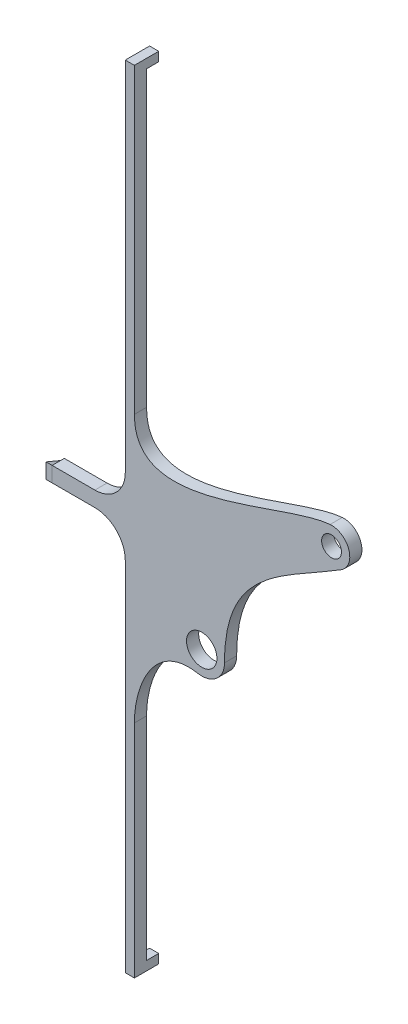
ISO-10303-21;
HEADER;
FILE_DESCRIPTION(('STEP AP214'),'2;1');
FILE_NAME('part.step','',(''),(''),'','','');
FILE_SCHEMA(('AUTOMOTIVE_DESIGN { 1 0 10303 214 1 1 1 1 }'));
ENDSEC;
DATA;
#1=APPLICATION_CONTEXT('core data for automotive mechanical design processes');
#2=APPLICATION_PROTOCOL_DEFINITION('international standard','automotive_design',2000,#1);
#3=PRODUCT_CONTEXT('',#1,'mechanical');
#4=PRODUCT('Part','Part','',(#3));
#5=PRODUCT_RELATED_PRODUCT_CATEGORY('part','',(#4));
#6=PRODUCT_DEFINITION_FORMATION('','',#4);
#7=PRODUCT_DEFINITION_CONTEXT('part definition',#1,'design');
#8=PRODUCT_DEFINITION('design','',#6,#7);
#9=PRODUCT_DEFINITION_SHAPE('','',#8);
#10=(LENGTH_UNIT() NAMED_UNIT(*) SI_UNIT(.MILLI.,.METRE.));
#11=(NAMED_UNIT(*) PLANE_ANGLE_UNIT() SI_UNIT($,.RADIAN.));
#12=(NAMED_UNIT(*) SI_UNIT($,.STERADIAN.) SOLID_ANGLE_UNIT());
#13=UNCERTAINTY_MEASURE_WITH_UNIT(LENGTH_MEASURE(1.E-05),#10,'distance_accuracy_value','');
#14=(GEOMETRIC_REPRESENTATION_CONTEXT(3) GLOBAL_UNCERTAINTY_ASSIGNED_CONTEXT((#13)) GLOBAL_UNIT_ASSIGNED_CONTEXT((#10,
#11,#12)) REPRESENTATION_CONTEXT('',''));
#15=CARTESIAN_POINT('',(0.,0.,0.));
#16=DIRECTION('',(0.,0.,1.));
#17=DIRECTION('',(1.,0.,0.));
#18=AXIS2_PLACEMENT_3D('',#15,#16,#17);
#19=CARTESIAN_POINT('',(-24.0499999999999,-2.50000000000001,4.));
#20=DIRECTION('',(0.,0.,-1.));
#21=DIRECTION('',(-1.,0.,0.));
#22=AXIS2_PLACEMENT_3D('',#19,#20,#21);
#23=PLANE('',#22);
#24=DIRECTION('',(0.,1.,0.));
#25=VECTOR('',#24,1.);
#26=CARTESIAN_POINT('',(-22.0499999999999,-2.50000000000001,4.));
#27=LINE('',#26,#25);
#28=CARTESIAN_POINT('',(-22.0499999999999,-2.50000000000001,4.));
#29=VERTEX_POINT('',#28);
#30=CARTESIAN_POINT('',(-22.0499999999999,2.50000000000002,4.));
#31=VERTEX_POINT('',#30);
#32=EDGE_CURVE('E92',#29,#31,#27,.T.);
#33=ORIENTED_EDGE('',*,*,#32,.T.);
#34=DIRECTION('',(1.,0.,0.));
#35=VECTOR('',#34,1.);
#36=CARTESIAN_POINT('',(-24.0499999999999,2.50000000000002,4.));
#37=LINE('',#36,#35);
#38=CARTESIAN_POINT('',(-24.0499999999999,2.50000000000002,4.));
#39=VERTEX_POINT('',#38);
#40=EDGE_CURVE('E12',#39,#31,#37,.T.);
#41=ORIENTED_EDGE('',*,*,#40,.F.);
#42=DIRECTION('',(0.,1.,0.));
#43=VECTOR('',#42,1.);
#44=CARTESIAN_POINT('',(-24.0499999999999,-2.50000000000001,4.));
#45=LINE('',#44,#43);
#46=CARTESIAN_POINT('',(-24.0499999999999,-2.50000000000001,4.));
#47=VERTEX_POINT('',#46);
#48=EDGE_CURVE('E85',#47,#39,#45,.T.);
#49=ORIENTED_EDGE('',*,*,#48,.F.);
#50=DIRECTION('',(1.,0.,0.));
#51=VECTOR('',#50,1.);
#52=CARTESIAN_POINT('',(-24.0499999999999,-2.50000000000001,4.));
#53=LINE('',#52,#51);
#54=EDGE_CURVE('E93',#47,#29,#53,.T.);
#55=ORIENTED_EDGE('',*,*,#54,.T.);
#56=EDGE_LOOP('',(#33,#41,#49,#55));
#57=FACE_BOUND('',#56,.T.);
#58=ADVANCED_FACE('F45',(#57),#23,.F.);
#59=CARTESIAN_POINT('',(-24.0499999999999,0.,-2.));
#60=DIRECTION('',(0.,-0.923076923076922,0.384615384615387));
#61=DIRECTION('',(0.,-0.384615384615387,-0.923076923076922));
#62=AXIS2_PLACEMENT_3D('',#59,#60,#61);
#63=PLANE('',#62);
#64=DIRECTION('',(0.,-0.384615384615387,-0.923076923076922));
#65=VECTOR('',#64,1.);
#66=CARTESIAN_POINT('',(-22.0499999999999,0.,-2.));
#67=LINE('',#66,#65);
#68=CARTESIAN_POINT('',(-22.0499999999999,0.,-2.));
#69=VERTEX_POINT('',#68);
#70=EDGE_CURVE('E73',#31,#69,#67,.T.);
#71=ORIENTED_EDGE('',*,*,#70,.T.);
#72=DIRECTION('',(1.,0.,0.));
#73=VECTOR('',#72,1.);
#74=CARTESIAN_POINT('',(-24.0499999999999,0.,-2.));
#75=LINE('',#74,#73);
#76=CARTESIAN_POINT('',(-24.0499999999999,0.,-2.));
#77=VERTEX_POINT('',#76);
#78=EDGE_CURVE('E53',#77,#69,#75,.T.);
#79=ORIENTED_EDGE('',*,*,#78,.F.);
#80=DIRECTION('',(0.,-0.384615384615387,-0.923076923076922));
#81=VECTOR('',#80,1.);
#82=CARTESIAN_POINT('',(-24.0499999999999,0.,-2.));
#83=LINE('',#82,#81);
#84=EDGE_CURVE('E81',#39,#77,#83,.T.);
#85=ORIENTED_EDGE('',*,*,#84,.F.);
#86=ORIENTED_EDGE('',*,*,#40,.T.);
#87=EDGE_LOOP('',(#71,#79,#85,#86));
#88=FACE_BOUND('',#87,.T.);
#89=ADVANCED_FACE('F82',(#88),#63,.F.);
#90=CARTESIAN_POINT('',(-24.0499999999999,-2.50000000000001,4.));
#91=DIRECTION('',(0.,0.923076923076922,0.384615384615386));
#92=DIRECTION('',(0.,-0.384615384615386,0.923076923076922));
#93=AXIS2_PLACEMENT_3D('',#90,#91,#92);
#94=PLANE('',#93);
#95=DIRECTION('',(0.,-0.384615384615386,0.923076923076922));
#96=VECTOR('',#95,1.);
#97=CARTESIAN_POINT('',(-22.0499999999999,-2.50000000000001,4.));
#98=LINE('',#97,#96);
#99=EDGE_CURVE('E78',#69,#29,#98,.T.);
#100=ORIENTED_EDGE('',*,*,#99,.T.);
#101=ORIENTED_EDGE('',*,*,#54,.F.);
#102=DIRECTION('',(0.,-0.384615384615386,0.923076923076922));
#103=VECTOR('',#102,1.);
#104=CARTESIAN_POINT('',(-24.0499999999999,-2.50000000000001,4.));
#105=LINE('',#104,#103);
#106=EDGE_CURVE('E61',#77,#47,#105,.T.);
#107=ORIENTED_EDGE('',*,*,#106,.F.);
#108=ORIENTED_EDGE('',*,*,#78,.T.);
#109=EDGE_LOOP('',(#100,#101,#107,#108));
#110=FACE_BOUND('',#109,.T.);
#111=ADVANCED_FACE('F100',(#110),#94,.F.);
#112=CARTESIAN_POINT('',(-24.0499999999999,0.,0.));
#113=DIRECTION('',(1.,0.,0.));
#114=DIRECTION('',(0.,0.,-1.));
#115=AXIS2_PLACEMENT_3D('',#112,#113,#114);
#116=PLANE('',#115);
#117=ORIENTED_EDGE('',*,*,#48,.T.);
#118=ORIENTED_EDGE('',*,*,#84,.T.);
#119=ORIENTED_EDGE('',*,*,#106,.T.);
#120=EDGE_LOOP('',(#117,#118,#119));
#121=FACE_BOUND('',#120,.T.);
#122=ADVANCED_FACE('F88',(#121),#116,.F.);
#123=CARTESIAN_POINT('',(-22.0499999999999,0.,0.));
#124=DIRECTION('',(1.,0.,0.));
#125=DIRECTION('',(0.,0.,-1.));
#126=AXIS2_PLACEMENT_3D('',#123,#124,#125);
#127=PLANE('',#126);
#128=ORIENTED_EDGE('',*,*,#32,.F.);
#129=ORIENTED_EDGE('',*,*,#99,.F.);
#130=ORIENTED_EDGE('',*,*,#70,.F.);
#131=EDGE_LOOP('',(#128,#129,#130));
#132=FACE_BOUND('',#131,.T.);
#133=ADVANCED_FACE('F101',(#132),#127,.T.);
#134=CLOSED_SHELL('',(#58,#89,#111,#122,#133));
#135=MANIFOLD_SOLID_BREP('B2',#134);
#136=CARTESIAN_POINT('',(0.,0.,0.));
#137=DIRECTION('',(0.,0.,1.));
#138=DIRECTION('',(1.,0.,0.));
#139=AXIS2_PLACEMENT_3D('',#136,#137,#138);
#140=PLANE('',#139);
#141=CARTESIAN_POINT('',(69.85,25.4,0.));
#142=DIRECTION('',(0.,0.,1.));
#143=DIRECTION('',(1.,0.,0.));
#144=AXIS2_PLACEMENT_3D('',#141,#142,#143);
#145=CIRCLE('',#144,3.26389999999999);
#146=CARTESIAN_POINT('',(73.1139,25.4,0.));
#147=VERTEX_POINT('',#146);
#148=EDGE_CURVE('E340',#147,#147,#145,.T.);
#149=ORIENTED_EDGE('',*,*,#148,.T.);
#150=EDGE_LOOP('',(#149));
#151=FACE_BOUND('',#150,.T.);
#152=CARTESIAN_POINT('',(27.15,-25.4,0.));
#153=DIRECTION('',(0.,0.,1.));
#154=DIRECTION('',(1.,0.,0.));
#155=AXIS2_PLACEMENT_3D('',#152,#153,#154);
#156=CIRCLE('',#155,5.);
#157=CARTESIAN_POINT('',(32.15,-25.4,0.));
#158=VERTEX_POINT('',#157);
#159=EDGE_CURVE('E458',#158,#158,#156,.T.);
#160=ORIENTED_EDGE('',*,*,#159,.T.);
#161=EDGE_LOOP('',(#160));
#162=FACE_BOUND('',#161,.T.);
#163=DIRECTION('',(-1.,0.,0.));
#164=VECTOR('',#163,1.);
#165=CARTESIAN_POINT('',(0.,127.,0.));
#166=LINE('',#165,#164);
#167=CARTESIAN_POINT('',(5.00000000000001,127.,0.));
#168=VERTEX_POINT('',#167);
#169=CARTESIAN_POINT('',(2.00000000000001,127.,0.));
#170=VERTEX_POINT('',#169);
#171=EDGE_CURVE('E305',#168,#170,#166,.T.);
#172=ORIENTED_EDGE('',*,*,#171,.F.);
#173=DIRECTION('',(0.,-1.,0.));
#174=VECTOR('',#173,1.);
#175=CARTESIAN_POINT('',(5.00000000000001,0.,0.));
#176=LINE('',#175,#174);
#177=CARTESIAN_POINT('',(5.00000000000001,30.5708800073371,0.));
#178=VERTEX_POINT('',#177);
#179=EDGE_CURVE('E295',#168,#178,#176,.T.);
#180=ORIENTED_EDGE('',*,*,#179,.T.);
#181=CARTESIAN_POINT('',(5.00000000000002,30.5708800073371,0.));
#182=CARTESIAN_POINT('',(5.00000000000002,2.644791947933,0.));
#183=CARTESIAN_POINT('',(53.2787246403706,30.0687012589804,0.));
#184=CARTESIAN_POINT('',(69.3623819699283,31.3801528957669,0.));
#185=B_SPLINE_CURVE_WITH_KNOTS('',3,(#181,#182,#183,#184),.UNSPECIFIED.,.F.,.F.,(4,4),(0.,1.),.UNSPECIFIED.);
#186=CARTESIAN_POINT('',(69.3623819699283,31.3801528957669,0.));
#187=VERTEX_POINT('',#186);
#188=EDGE_CURVE('E424',#178,#187,#185,.T.);
#189=ORIENTED_EDGE('',*,*,#188,.T.);
#190=CARTESIAN_POINT('',(69.85,25.4,0.));
#191=DIRECTION('',(0.,0.,1.));
#192=DIRECTION('',(1.,0.,0.));
#193=AXIS2_PLACEMENT_3D('',#190,#191,#192);
#194=CIRCLE('',#193,6.);
#195=CARTESIAN_POINT('',(73.0223668687448,20.3072513855394,0.));
#196=VERTEX_POINT('',#195);
#197=EDGE_CURVE('E418',#196,#187,#194,.T.);
#198=ORIENTED_EDGE('',*,*,#197,.F.);
#199=CARTESIAN_POINT('',(73.0223668687447,20.3072513855397,0.));
#200=CARTESIAN_POINT('',(54.015932593088,8.46779356940645,0.));
#201=CARTESIAN_POINT('',(34.6134957490647,2.87312155456971,0.));
#202=CARTESIAN_POINT('',(34.6499937465617,-25.3903148807254,0.));
#203=B_SPLINE_CURVE_WITH_KNOTS('',3,(#199,#200,#201,#202),.UNSPECIFIED.,.F.,.F.,(4,4),(0.,1.),.UNSPECIFIED.);
#204=CARTESIAN_POINT('',(34.6499937465617,-25.3903148807254,0.));
#205=VERTEX_POINT('',#204);
#206=EDGE_CURVE('E331',#196,#205,#203,.T.);
#207=ORIENTED_EDGE('',*,*,#206,.T.);
#208=CARTESIAN_POINT('',(27.15,-25.4,0.));
#209=DIRECTION('',(0.,0.,1.));
#210=DIRECTION('',(1.,0.,0.));
#211=AXIS2_PLACEMENT_3D('',#208,#209,#210);
#212=CIRCLE('',#211,7.5);
#213=CARTESIAN_POINT('',(25.812302368487,-32.7797401747382,0.));
#214=VERTEX_POINT('',#213);
#215=EDGE_CURVE('E452',#214,#205,#212,.T.);
#216=ORIENTED_EDGE('',*,*,#215,.F.);
#217=CARTESIAN_POINT('',(25.812302368487,-32.7797401747382,0.));
#218=CARTESIAN_POINT('',(11.7792875112904,-30.2360285679641,0.));
#219=CARTESIAN_POINT('',(4.99999999999995,-45.7386077924524,0.));
#220=CARTESIAN_POINT('',(5.00000000000001,-57.3401483146963,0.));
#221=B_SPLINE_CURVE_WITH_KNOTS('',3,(#217,#218,#219,#220),.UNSPECIFIED.,.F.,.F.,(4,4),(0.,1.),.UNSPECIFIED.);
#222=CARTESIAN_POINT('',(5.00000000000001,-57.3401483146963,0.));
#223=VERTEX_POINT('',#222);
#224=EDGE_CURVE('E447',#214,#223,#221,.T.);
#225=ORIENTED_EDGE('',*,*,#224,.T.);
#226=CARTESIAN_POINT('',(5.00000000000001,-127.,0.));
#227=VERTEX_POINT('',#226);
#228=EDGE_CURVE('E434',#223,#227,#176,.T.);
#229=ORIENTED_EDGE('',*,*,#228,.T.);
#230=DIRECTION('',(-1.,0.,0.));
#231=VECTOR('',#230,1.);
#232=CARTESIAN_POINT('',(0.,-127.,0.));
#233=LINE('',#232,#231);
#234=CARTESIAN_POINT('',(2.00000000000001,-127.,0.));
#235=VERTEX_POINT('',#234);
#236=EDGE_CURVE('E311',#227,#235,#233,.T.);
#237=ORIENTED_EDGE('',*,*,#236,.T.);
#238=DIRECTION('',(0.,-1.,0.));
#239=VECTOR('',#238,1.);
#240=CARTESIAN_POINT('',(2.00000000000001,0.,0.));
#241=LINE('',#240,#239);
#242=CARTESIAN_POINT('',(2.00000000000001,-12.5,0.));
#243=VERTEX_POINT('',#242);
#244=EDGE_CURVE('E445',#243,#235,#241,.T.);
#245=ORIENTED_EDGE('',*,*,#244,.F.);
#246=CARTESIAN_POINT('',(-7.99999999999999,-12.5,0.));
#247=DIRECTION('',(0.,0.,1.));
#248=DIRECTION('',(1.,0.,0.));
#249=AXIS2_PLACEMENT_3D('',#246,#247,#248);
#250=CIRCLE('',#249,10.);
#251=CARTESIAN_POINT('',(-7.99999999999999,-2.5,0.));
#252=VERTEX_POINT('',#251);
#253=EDGE_CURVE('E151',#243,#252,#250,.T.);
#254=ORIENTED_EDGE('',*,*,#253,.T.);
#255=DIRECTION('',(1.,0.,0.));
#256=VECTOR('',#255,1.);
#257=CARTESIAN_POINT('',(0.,-2.5,0.));
#258=LINE('',#257,#256);
#259=CARTESIAN_POINT('',(-22.0499999999999,-2.5,0.));
#260=VERTEX_POINT('',#259);
#261=EDGE_CURVE('E443',#260,#252,#258,.T.);
#262=ORIENTED_EDGE('',*,*,#261,.F.);
#263=DIRECTION('',(0.,1.,0.));
#264=VECTOR('',#263,1.);
#265=CARTESIAN_POINT('',(-22.0499999999999,0.,0.));
#266=LINE('',#265,#264);
#267=CARTESIAN_POINT('',(-22.0499999999999,2.5,0.));
#268=VERTEX_POINT('',#267);
#269=EDGE_CURVE('E440',#260,#268,#266,.T.);
#270=ORIENTED_EDGE('',*,*,#269,.T.);
#271=DIRECTION('',(1.,0.,0.));
#272=VECTOR('',#271,1.);
#273=CARTESIAN_POINT('',(0.,2.5,0.));
#274=LINE('',#273,#272);
#275=CARTESIAN_POINT('',(-7.99999999999999,2.5,0.));
#276=VERTEX_POINT('',#275);
#277=EDGE_CURVE('E437',#268,#276,#274,.T.);
#278=ORIENTED_EDGE('',*,*,#277,.T.);
#279=CARTESIAN_POINT('',(-7.99999999999999,12.5,0.));
#280=DIRECTION('',(0.,0.,1.));
#281=DIRECTION('',(1.,0.,0.));
#282=AXIS2_PLACEMENT_3D('',#279,#280,#281);
#283=CIRCLE('',#282,10.);
#284=CARTESIAN_POINT('',(2.00000000000001,12.5,0.));
#285=VERTEX_POINT('',#284);
#286=EDGE_CURVE('E494',#276,#285,#283,.T.);
#287=ORIENTED_EDGE('',*,*,#286,.T.);
#288=DIRECTION('',(0.,-1.,0.));
#289=VECTOR('',#288,1.);
#290=CARTESIAN_POINT('',(2.00000000000001,0.,0.));
#291=LINE('',#290,#289);
#292=EDGE_CURVE('E433',#170,#285,#291,.T.);
#293=ORIENTED_EDGE('',*,*,#292,.F.);
#294=EDGE_LOOP('',(#172,#180,#189,#198,#207,#216,#225,#229,#237,#245,#254,#262,#270,#278,#287,#293));
#295=FACE_BOUND('',#294,.T.);
#296=ADVANCED_FACE('F143',(#151,#162,#295),#140,.F.);
#297=CARTESIAN_POINT('',(73.0223668687447,20.3072513855397,4.));
#298=CARTESIAN_POINT('',(54.015932593088,8.46779356940645,4.));
#299=CARTESIAN_POINT('',(34.6134957490647,2.87312155456971,4.));
#300=CARTESIAN_POINT('',(34.6499937465617,-25.3903148807254,4.));
#301=B_SPLINE_CURVE_WITH_KNOTS('',3,(#297,#298,#299,#300),.UNSPECIFIED.,.F.,.F.,(4,4),(0.,1.),.UNSPECIFIED.);
#302=DIRECTION('',(0.,0.,-1.));
#303=VECTOR('',#302,1.);
#304=SURFACE_OF_LINEAR_EXTRUSION('',#301,#303);
#305=ORIENTED_EDGE('',*,*,#206,.F.);
#306=DIRECTION('',(0.,0.,-1.));
#307=VECTOR('',#306,1.);
#308=CARTESIAN_POINT('',(73.0223668687448,20.3072513855394,4.));
#309=LINE('',#308,#307);
#310=CARTESIAN_POINT('',(73.0223668687448,20.3072513855394,4.));
#311=VERTEX_POINT('',#310);
#312=EDGE_CURVE('E483',#311,#196,#309,.T.);
#313=ORIENTED_EDGE('',*,*,#312,.F.);
#314=CARTESIAN_POINT('',(34.6499937465617,-25.3903148807254,4.));
#315=VERTEX_POINT('',#314);
#316=EDGE_CURVE('E333',#311,#315,#301,.T.);
#317=ORIENTED_EDGE('',*,*,#316,.T.);
#318=DIRECTION('',(0.,0.,-1.));
#319=VECTOR('',#318,1.);
#320=CARTESIAN_POINT('',(34.6499937465617,-25.3903148807254,4.));
#321=LINE('',#320,#319);
#322=EDGE_CURVE('E413',#315,#205,#321,.T.);
#323=ORIENTED_EDGE('',*,*,#322,.T.);
#324=EDGE_LOOP('',(#305,#313,#317,#323));
#325=FACE_BOUND('',#324,.T.);
#326=ADVANCED_FACE('F346',(#325),#304,.T.);
#327=CARTESIAN_POINT('',(69.85,25.4,4.));
#328=DIRECTION('',(0.,0.,-1.));
#329=DIRECTION('',(-1.,0.,0.));
#330=AXIS2_PLACEMENT_3D('',#327,#328,#329);
#331=CYLINDRICAL_SURFACE('',#330,6.);
#332=ORIENTED_EDGE('',*,*,#197,.T.);
#333=DIRECTION('',(0.,0.,-1.));
#334=VECTOR('',#333,1.);
#335=CARTESIAN_POINT('',(69.3623819699283,31.3801528957669,4.));
#336=LINE('',#335,#334);
#337=CARTESIAN_POINT('',(69.3623819699283,31.3801528957669,4.));
#338=VERTEX_POINT('',#337);
#339=EDGE_CURVE('E481',#338,#187,#336,.T.);
#340=ORIENTED_EDGE('',*,*,#339,.F.);
#341=CARTESIAN_POINT('',(69.85,25.4,4.));
#342=DIRECTION('',(0.,0.,1.));
#343=DIRECTION('',(1.,0.,0.));
#344=AXIS2_PLACEMENT_3D('',#341,#342,#343);
#345=CIRCLE('',#344,6.);
#346=EDGE_CURVE('E339',#311,#338,#345,.T.);
#347=ORIENTED_EDGE('',*,*,#346,.F.);
#348=ORIENTED_EDGE('',*,*,#312,.T.);
#349=EDGE_LOOP('',(#332,#340,#347,#348));
#350=FACE_BOUND('',#349,.T.);
#351=ADVANCED_FACE('F349',(#350),#331,.T.);
#352=CARTESIAN_POINT('',(5.00000000000002,30.5708800073371,4.));
#353=CARTESIAN_POINT('',(5.00000000000002,2.644791947933,4.));
#354=CARTESIAN_POINT('',(53.2787246403706,30.0687012589804,4.));
#355=CARTESIAN_POINT('',(69.3623819699283,31.3801528957669,4.));
#356=B_SPLINE_CURVE_WITH_KNOTS('',3,(#352,#353,#354,#355),.UNSPECIFIED.,.F.,.F.,(4,4),(0.,1.),.UNSPECIFIED.);
#357=DIRECTION('',(0.,0.,-1.));
#358=VECTOR('',#357,1.);
#359=SURFACE_OF_LINEAR_EXTRUSION('',#356,#358);
#360=ORIENTED_EDGE('',*,*,#188,.F.);
#361=DIRECTION('',(0.,0.,-1.));
#362=VECTOR('',#361,1.);
#363=CARTESIAN_POINT('',(5.00000000000001,30.5708800073371,4.));
#364=LINE('',#363,#362);
#365=CARTESIAN_POINT('',(5.00000000000001,30.5708800073371,4.));
#366=VERTEX_POINT('',#365);
#367=EDGE_CURVE('E479',#366,#178,#364,.T.);
#368=ORIENTED_EDGE('',*,*,#367,.F.);
#369=EDGE_CURVE('E528',#366,#338,#356,.T.);
#370=ORIENTED_EDGE('',*,*,#369,.T.);
#371=ORIENTED_EDGE('',*,*,#339,.T.);
#372=EDGE_LOOP('',(#360,#368,#370,#371));
#373=FACE_BOUND('',#372,.T.);
#374=ADVANCED_FACE('F526',(#373),#359,.T.);
#375=CARTESIAN_POINT('',(5.00000000000001,0.,4.));
#376=DIRECTION('',(1.,0.,0.));
#377=DIRECTION('',(0.,0.,-1.));
#378=AXIS2_PLACEMENT_3D('',#375,#376,#377);
#379=PLANE('',#378);
#380=ORIENTED_EDGE('',*,*,#179,.F.);
#381=DIRECTION('',(0.,0.,1.));
#382=VECTOR('',#381,1.);
#383=CARTESIAN_POINT('',(5.00000000000001,127.,-4.));
#384=LINE('',#383,#382);
#385=CARTESIAN_POINT('',(5.00000000000001,127.,-4.));
#386=VERTEX_POINT('',#385);
#387=EDGE_CURVE('E292',#386,#168,#384,.T.);
#388=ORIENTED_EDGE('',*,*,#387,.F.);
#389=DIRECTION('',(0.,-1.,0.));
#390=VECTOR('',#389,1.);
#391=CARTESIAN_POINT('',(5.00000000000001,0.,-4.));
#392=LINE('',#391,#390);
#393=CARTESIAN_POINT('',(5.00000000000001,130.,-4.));
#394=VERTEX_POINT('',#393);
#395=EDGE_CURVE('E280',#394,#386,#392,.T.);
#396=ORIENTED_EDGE('',*,*,#395,.F.);
#397=DIRECTION('',(0.,0.,-1.));
#398=VECTOR('',#397,1.);
#399=CARTESIAN_POINT('',(5.00000000000001,130.,4.));
#400=LINE('',#399,#398);
#401=CARTESIAN_POINT('',(5.00000000000001,130.,4.));
#402=VERTEX_POINT('',#401);
#403=EDGE_CURVE('E477',#402,#394,#400,.T.);
#404=ORIENTED_EDGE('',*,*,#403,.F.);
#405=DIRECTION('',(0.,-1.,0.));
#406=VECTOR('',#405,1.);
#407=CARTESIAN_POINT('',(5.00000000000001,0.,4.));
#408=LINE('',#407,#406);
#409=EDGE_CURVE('E522',#402,#366,#408,.T.);
#410=ORIENTED_EDGE('',*,*,#409,.T.);
#411=ORIENTED_EDGE('',*,*,#367,.T.);
#412=EDGE_LOOP('',(#380,#388,#396,#404,#410,#411));
#413=FACE_BOUND('',#412,.T.);
#414=ADVANCED_FACE('F293',(#413),#379,.T.);
#415=CARTESIAN_POINT('',(0.,130.,4.));
#416=DIRECTION('',(0.,1.,0.));
#417=DIRECTION('',(0.,0.,1.));
#418=AXIS2_PLACEMENT_3D('',#415,#416,#417);
#419=PLANE('',#418);
#420=ORIENTED_EDGE('',*,*,#403,.T.);
#421=DIRECTION('',(1.,0.,0.));
#422=VECTOR('',#421,1.);
#423=CARTESIAN_POINT('',(0.,130.,-4.));
#424=LINE('',#423,#422);
#425=CARTESIAN_POINT('',(2.00000000000001,130.,-4.));
#426=VERTEX_POINT('',#425);
#427=EDGE_CURVE('E288',#426,#394,#424,.T.);
#428=ORIENTED_EDGE('',*,*,#427,.F.);
#429=DIRECTION('',(0.,0.,-1.));
#430=VECTOR('',#429,1.);
#431=CARTESIAN_POINT('',(2.00000000000001,130.,4.));
#432=LINE('',#431,#430);
#433=CARTESIAN_POINT('',(2.00000000000001,130.,4.));
#434=VERTEX_POINT('',#433);
#435=EDGE_CURVE('E475',#434,#426,#432,.T.);
#436=ORIENTED_EDGE('',*,*,#435,.F.);
#437=DIRECTION('',(1.,0.,0.));
#438=VECTOR('',#437,1.);
#439=CARTESIAN_POINT('',(0.,130.,4.));
#440=LINE('',#439,#438);
#441=EDGE_CURVE('E567',#434,#402,#440,.T.);
#442=ORIENTED_EDGE('',*,*,#441,.T.);
#443=EDGE_LOOP('',(#420,#428,#436,#442));
#444=FACE_BOUND('',#443,.T.);
#445=ADVANCED_FACE('F578',(#444),#419,.T.);
#446=CARTESIAN_POINT('',(2.00000000000001,0.,4.));
#447=DIRECTION('',(1.,0.,0.));
#448=DIRECTION('',(0.,0.,-1.));
#449=AXIS2_PLACEMENT_3D('',#446,#447,#448);
#450=PLANE('',#449);
#451=ORIENTED_EDGE('',*,*,#292,.T.);
#452=DIRECTION('',(0.,0.,-1.));
#453=VECTOR('',#452,1.);
#454=CARTESIAN_POINT('',(2.00000000000001,12.5,4.));
#455=LINE('',#454,#453);
#456=CARTESIAN_POINT('',(2.00000000000001,12.5,4.));
#457=VERTEX_POINT('',#456);
#458=EDGE_CURVE('E488',#285,#457,#455,.F.);
#459=ORIENTED_EDGE('',*,*,#458,.T.);
#460=DIRECTION('',(0.,-1.,0.));
#461=VECTOR('',#460,1.);
#462=CARTESIAN_POINT('',(2.00000000000001,0.,4.));
#463=LINE('',#462,#461);
#464=EDGE_CURVE('E508',#434,#457,#463,.T.);
#465=ORIENTED_EDGE('',*,*,#464,.F.);
#466=ORIENTED_EDGE('',*,*,#435,.T.);
#467=DIRECTION('',(0.,-1.,0.));
#468=VECTOR('',#467,1.);
#469=CARTESIAN_POINT('',(2.00000000000001,0.,-4.));
#470=LINE('',#469,#468);
#471=CARTESIAN_POINT('',(2.00000000000001,127.,-4.));
#472=VERTEX_POINT('',#471);
#473=EDGE_CURVE('E300',#426,#472,#470,.T.);
#474=ORIENTED_EDGE('',*,*,#473,.T.);
#475=DIRECTION('',(0.,0.,1.));
#476=VECTOR('',#475,1.);
#477=CARTESIAN_POINT('',(2.00000000000001,127.,-4.));
#478=LINE('',#477,#476);
#479=EDGE_CURVE('E299',#472,#170,#478,.T.);
#480=ORIENTED_EDGE('',*,*,#479,.T.);
#481=EDGE_LOOP('',(#451,#459,#465,#466,#474,#480));
#482=FACE_BOUND('',#481,.T.);
#483=ADVANCED_FACE('F517',(#482),#450,.F.);
#484=CARTESIAN_POINT('',(0.,2.5,4.));
#485=DIRECTION('',(0.,1.,0.));
#486=DIRECTION('',(-1.,0.,0.));
#487=AXIS2_PLACEMENT_3D('',#484,#485,#486);
#488=PLANE('',#487);
#489=DIRECTION('',(1.,0.,0.));
#490=VECTOR('',#489,1.);
#491=CARTESIAN_POINT('',(0.,2.5,4.));
#492=LINE('',#491,#490);
#493=CARTESIAN_POINT('',(-22.0499999999999,2.5,4.));
#494=VERTEX_POINT('',#493);
#495=CARTESIAN_POINT('',(-7.99999999999999,2.5,4.));
#496=VERTEX_POINT('',#495);
#497=EDGE_CURVE('E504',#494,#496,#492,.T.);
#498=ORIENTED_EDGE('',*,*,#497,.T.);
#499=DIRECTION('',(0.,0.,-1.));
#500=VECTOR('',#499,1.);
#501=CARTESIAN_POINT('',(-7.99999999999999,2.5,4.));
#502=LINE('',#501,#500);
#503=EDGE_CURVE('E485',#496,#276,#502,.T.);
#504=ORIENTED_EDGE('',*,*,#503,.T.);
#505=ORIENTED_EDGE('',*,*,#277,.F.);
#506=DIRECTION('',(0.,0.,-1.));
#507=VECTOR('',#506,1.);
#508=CARTESIAN_POINT('',(-22.0499999999999,2.5,4.));
#509=LINE('',#508,#507);
#510=EDGE_CURVE('E473',#494,#268,#509,.T.);
#511=ORIENTED_EDGE('',*,*,#510,.F.);
#512=EDGE_LOOP('',(#498,#504,#505,#511));
#513=FACE_BOUND('',#512,.T.);
#514=ADVANCED_FACE('F512',(#513),#488,.T.);
#515=CARTESIAN_POINT('',(-22.0499999999999,0.,4.));
#516=DIRECTION('',(-1.,0.,0.));
#517=DIRECTION('',(0.,0.,1.));
#518=AXIS2_PLACEMENT_3D('',#515,#516,#517);
#519=PLANE('',#518);
#520=ORIENTED_EDGE('',*,*,#269,.F.);
#521=DIRECTION('',(0.,0.,-1.));
#522=VECTOR('',#521,1.);
#523=CARTESIAN_POINT('',(-22.0499999999999,-2.5,4.));
#524=LINE('',#523,#522);
#525=CARTESIAN_POINT('',(-22.0499999999999,-2.5,4.));
#526=VERTEX_POINT('',#525);
#527=EDGE_CURVE('E471',#526,#260,#524,.T.);
#528=ORIENTED_EDGE('',*,*,#527,.F.);
#529=DIRECTION('',(0.,1.,0.));
#530=VECTOR('',#529,1.);
#531=CARTESIAN_POINT('',(-22.0499999999999,0.,4.));
#532=LINE('',#531,#530);
#533=EDGE_CURVE('E514',#526,#494,#532,.T.);
#534=ORIENTED_EDGE('',*,*,#533,.T.);
#535=ORIENTED_EDGE('',*,*,#510,.T.);
#536=EDGE_LOOP('',(#520,#528,#534,#535));
#537=FACE_BOUND('',#536,.T.);
#538=ADVANCED_FACE('F586',(#537),#519,.T.);
#539=CARTESIAN_POINT('',(0.,-2.5,4.));
#540=DIRECTION('',(0.,1.,0.));
#541=DIRECTION('',(-1.,0.,0.));
#542=AXIS2_PLACEMENT_3D('',#539,#540,#541);
#543=PLANE('',#542);
#544=ORIENTED_EDGE('',*,*,#261,.T.);
#545=DIRECTION('',(0.,0.,-1.));
#546=VECTOR('',#545,1.);
#547=CARTESIAN_POINT('',(-7.99999999999999,-2.5,4.));
#548=LINE('',#547,#546);
#549=CARTESIAN_POINT('',(-7.99999999999999,-2.5,4.));
#550=VERTEX_POINT('',#549);
#551=EDGE_CURVE('E158',#252,#550,#548,.F.);
#552=ORIENTED_EDGE('',*,*,#551,.T.);
#553=DIRECTION('',(1.,0.,0.));
#554=VECTOR('',#553,1.);
#555=CARTESIAN_POINT('',(0.,-2.5,4.));
#556=LINE('',#555,#554);
#557=EDGE_CURVE('E561',#526,#550,#556,.T.);
#558=ORIENTED_EDGE('',*,*,#557,.F.);
#559=ORIENTED_EDGE('',*,*,#527,.T.);
#560=EDGE_LOOP('',(#544,#552,#558,#559));
#561=FACE_BOUND('',#560,.T.);
#562=ADVANCED_FACE('F589',(#561),#543,.F.);
#563=CARTESIAN_POINT('',(2.00000000000001,0.,4.));
#564=DIRECTION('',(1.,0.,0.));
#565=DIRECTION('',(0.,0.,-1.));
#566=AXIS2_PLACEMENT_3D('',#563,#564,#565);
#567=PLANE('',#566);
#568=DIRECTION('',(0.,-1.,0.));
#569=VECTOR('',#568,1.);
#570=CARTESIAN_POINT('',(2.00000000000001,0.,4.));
#571=LINE('',#570,#569);
#572=CARTESIAN_POINT('',(2.00000000000001,-12.5,4.));
#573=VERTEX_POINT('',#572);
#574=CARTESIAN_POINT('',(2.00000000000001,-130.,4.));
#575=VERTEX_POINT('',#574);
#576=EDGE_CURVE('E559',#573,#575,#571,.T.);
#577=ORIENTED_EDGE('',*,*,#576,.F.);
#578=DIRECTION('',(0.,0.,-1.));
#579=VECTOR('',#578,1.);
#580=CARTESIAN_POINT('',(2.00000000000001,-12.5,0.));
#581=LINE('',#580,#579);
#582=EDGE_CURVE('E490',#573,#243,#581,.T.);
#583=ORIENTED_EDGE('',*,*,#582,.T.);
#584=ORIENTED_EDGE('',*,*,#244,.T.);
#585=DIRECTION('',(0.,0.,1.));
#586=VECTOR('',#585,1.);
#587=CARTESIAN_POINT('',(2.00000000000001,-127.,-4.));
#588=LINE('',#587,#586);
#589=CARTESIAN_POINT('',(2.00000000000001,-127.,-4.));
#590=VERTEX_POINT('',#589);
#591=EDGE_CURVE('E328',#590,#235,#588,.T.);
#592=ORIENTED_EDGE('',*,*,#591,.F.);
#593=DIRECTION('',(0.,-1.,0.));
#594=VECTOR('',#593,1.);
#595=CARTESIAN_POINT('',(2.00000000000001,0.,-4.));
#596=LINE('',#595,#594);
#597=CARTESIAN_POINT('',(2.00000000000001,-130.,-4.));
#598=VERTEX_POINT('',#597);
#599=EDGE_CURVE('E319',#590,#598,#596,.T.);
#600=ORIENTED_EDGE('',*,*,#599,.T.);
#601=DIRECTION('',(0.,0.,-1.));
#602=VECTOR('',#601,1.);
#603=CARTESIAN_POINT('',(2.00000000000001,-130.,4.));
#604=LINE('',#603,#602);
#605=EDGE_CURVE('E469',#575,#598,#604,.T.);
#606=ORIENTED_EDGE('',*,*,#605,.F.);
#607=EDGE_LOOP('',(#577,#583,#584,#592,#600,#606));
#608=FACE_BOUND('',#607,.T.);
#609=ADVANCED_FACE('F550',(#608),#567,.F.);
#610=CARTESIAN_POINT('',(0.,-130.,4.));
#611=DIRECTION('',(0.,1.,0.));
#612=DIRECTION('',(0.,0.,1.));
#613=AXIS2_PLACEMENT_3D('',#610,#611,#612);
#614=PLANE('',#613);
#615=ORIENTED_EDGE('',*,*,#605,.T.);
#616=DIRECTION('',(1.,0.,0.));
#617=VECTOR('',#616,1.);
#618=CARTESIAN_POINT('',(0.,-130.,-4.));
#619=LINE('',#618,#617);
#620=CARTESIAN_POINT('',(5.00000000000001,-130.,-4.));
#621=VERTEX_POINT('',#620);
#622=EDGE_CURVE('E322',#598,#621,#619,.T.);
#623=ORIENTED_EDGE('',*,*,#622,.T.);
#624=DIRECTION('',(0.,0.,-1.));
#625=VECTOR('',#624,1.);
#626=CARTESIAN_POINT('',(5.00000000000001,-130.,4.));
#627=LINE('',#626,#625);
#628=CARTESIAN_POINT('',(5.00000000000001,-130.,4.));
#629=VERTEX_POINT('',#628);
#630=EDGE_CURVE('E467',#629,#621,#627,.T.);
#631=ORIENTED_EDGE('',*,*,#630,.F.);
#632=DIRECTION('',(1.,0.,0.));
#633=VECTOR('',#632,1.);
#634=CARTESIAN_POINT('',(0.,-130.,4.));
#635=LINE('',#634,#633);
#636=EDGE_CURVE('E401',#575,#629,#635,.T.);
#637=ORIENTED_EDGE('',*,*,#636,.F.);
#638=EDGE_LOOP('',(#615,#623,#631,#637));
#639=FACE_BOUND('',#638,.T.);
#640=ADVANCED_FACE('F557',(#639),#614,.F.);
#641=ORIENTED_EDGE('',*,*,#228,.F.);
#642=DIRECTION('',(0.,0.,-1.));
#643=VECTOR('',#642,1.);
#644=CARTESIAN_POINT('',(5.00000000000001,-57.3401483146963,4.));
#645=LINE('',#644,#643);
#646=CARTESIAN_POINT('',(5.00000000000001,-57.3401483146963,4.));
#647=VERTEX_POINT('',#646);
#648=EDGE_CURVE('E465',#647,#223,#645,.T.);
#649=ORIENTED_EDGE('',*,*,#648,.F.);
#650=EDGE_CURVE('E400',#647,#629,#408,.T.);
#651=ORIENTED_EDGE('',*,*,#650,.T.);
#652=ORIENTED_EDGE('',*,*,#630,.T.);
#653=DIRECTION('',(0.,-1.,0.));
#654=VECTOR('',#653,1.);
#655=CARTESIAN_POINT('',(5.00000000000001,0.,-4.));
#656=LINE('',#655,#654);
#657=CARTESIAN_POINT('',(5.00000000000001,-127.,-4.));
#658=VERTEX_POINT('',#657);
#659=EDGE_CURVE('E313',#658,#621,#656,.T.);
#660=ORIENTED_EDGE('',*,*,#659,.F.);
#661=DIRECTION('',(0.,0.,1.));
#662=VECTOR('',#661,1.);
#663=CARTESIAN_POINT('',(5.00000000000001,-127.,-4.));
#664=LINE('',#663,#662);
#665=EDGE_CURVE('E325',#658,#227,#664,.T.);
#666=ORIENTED_EDGE('',*,*,#665,.T.);
#667=EDGE_LOOP('',(#641,#649,#651,#652,#660,#666));
#668=FACE_BOUND('',#667,.T.);
#669=ADVANCED_FACE('F389',(#668),#379,.T.);
#670=CARTESIAN_POINT('',(25.812302368487,-32.7797401747382,4.));
#671=CARTESIAN_POINT('',(11.7792875112904,-30.2360285679641,4.));
#672=CARTESIAN_POINT('',(4.99999999999995,-45.7386077924524,4.));
#673=CARTESIAN_POINT('',(5.00000000000001,-57.3401483146963,4.));
#674=B_SPLINE_CURVE_WITH_KNOTS('',3,(#670,#671,#672,#673),.UNSPECIFIED.,.F.,.F.,(4,4),(0.,1.),.UNSPECIFIED.);
#675=DIRECTION('',(0.,0.,-1.));
#676=VECTOR('',#675,1.);
#677=SURFACE_OF_LINEAR_EXTRUSION('',#674,#676);
#678=ORIENTED_EDGE('',*,*,#224,.F.);
#679=DIRECTION('',(0.,0.,-1.));
#680=VECTOR('',#679,1.);
#681=CARTESIAN_POINT('',(25.812302368487,-32.7797401747382,4.));
#682=LINE('',#681,#680);
#683=CARTESIAN_POINT('',(25.812302368487,-32.7797401747382,4.));
#684=VERTEX_POINT('',#683);
#685=EDGE_CURVE('E463',#684,#214,#682,.T.);
#686=ORIENTED_EDGE('',*,*,#685,.F.);
#687=EDGE_CURVE('E392',#684,#647,#674,.T.);
#688=ORIENTED_EDGE('',*,*,#687,.T.);
#689=ORIENTED_EDGE('',*,*,#648,.T.);
#690=EDGE_LOOP('',(#678,#686,#688,#689));
#691=FACE_BOUND('',#690,.T.);
#692=ADVANCED_FACE('F381',(#691),#677,.T.);
#693=CARTESIAN_POINT('',(27.15,-25.4,4.));
#694=DIRECTION('',(0.,0.,-1.));
#695=DIRECTION('',(-1.,0.,0.));
#696=AXIS2_PLACEMENT_3D('',#693,#694,#695);
#697=CYLINDRICAL_SURFACE('',#696,5.);
#698=CARTESIAN_POINT('',(27.15,-25.4,4.));
#699=DIRECTION('',(0.,0.,1.));
#700=DIRECTION('',(1.,0.,0.));
#701=AXIS2_PLACEMENT_3D('',#698,#699,#700);
#702=CIRCLE('',#701,5.);
#703=CARTESIAN_POINT('',(32.15,-25.4,4.));
#704=VERTEX_POINT('',#703);
#705=EDGE_CURVE('E407',#704,#704,#702,.T.);
#706=ORIENTED_EDGE('',*,*,#705,.T.);
#707=EDGE_LOOP('',(#706));
#708=FACE_BOUND('',#707,.T.);
#709=ORIENTED_EDGE('',*,*,#159,.F.);
#710=EDGE_LOOP('',(#709));
#711=FACE_BOUND('',#710,.T.);
#712=ADVANCED_FACE('F378',(#708,#711),#697,.F.);
#713=CARTESIAN_POINT('',(27.15,-25.4,4.));
#714=DIRECTION('',(0.,0.,-1.));
#715=DIRECTION('',(-1.,0.,0.));
#716=AXIS2_PLACEMENT_3D('',#713,#714,#715);
#717=CYLINDRICAL_SURFACE('',#716,7.5);
#718=ORIENTED_EDGE('',*,*,#215,.T.);
#719=ORIENTED_EDGE('',*,*,#322,.F.);
#720=CARTESIAN_POINT('',(27.15,-25.4,4.));
#721=DIRECTION('',(0.,0.,1.));
#722=DIRECTION('',(1.,0.,0.));
#723=AXIS2_PLACEMENT_3D('',#720,#721,#722);
#724=CIRCLE('',#723,7.5);
#725=EDGE_CURVE('E399',#684,#315,#724,.T.);
#726=ORIENTED_EDGE('',*,*,#725,.F.);
#727=ORIENTED_EDGE('',*,*,#685,.T.);
#728=EDGE_LOOP('',(#718,#719,#726,#727));
#729=FACE_BOUND('',#728,.T.);
#730=ADVANCED_FACE('F376',(#729),#717,.T.);
#731=CARTESIAN_POINT('',(69.85,25.4,4.));
#732=DIRECTION('',(0.,0.,-1.));
#733=DIRECTION('',(-1.,0.,0.));
#734=AXIS2_PLACEMENT_3D('',#731,#732,#733);
#735=CYLINDRICAL_SURFACE('',#734,3.26389999999999);
#736=CARTESIAN_POINT('',(69.85,25.4,4.));
#737=DIRECTION('',(0.,0.,1.));
#738=DIRECTION('',(1.,0.,0.));
#739=AXIS2_PLACEMENT_3D('',#736,#737,#738);
#740=CIRCLE('',#739,3.26389999999999);
#741=CARTESIAN_POINT('',(73.1139,25.4,4.));
#742=VERTEX_POINT('',#741);
#743=EDGE_CURVE('E410',#742,#742,#740,.T.);
#744=ORIENTED_EDGE('',*,*,#743,.T.);
#745=EDGE_LOOP('',(#744));
#746=FACE_BOUND('',#745,.T.);
#747=ORIENTED_EDGE('',*,*,#148,.F.);
#748=EDGE_LOOP('',(#747));
#749=FACE_BOUND('',#748,.T.);
#750=ADVANCED_FACE('F373',(#746,#749),#735,.F.);
#751=CARTESIAN_POINT('',(0.,0.,4.));
#752=DIRECTION('',(0.,0.,1.));
#753=DIRECTION('',(1.,0.,0.));
#754=AXIS2_PLACEMENT_3D('',#751,#752,#753);
#755=PLANE('',#754);
#756=ORIENTED_EDGE('',*,*,#316,.F.);
#757=ORIENTED_EDGE('',*,*,#346,.T.);
#758=ORIENTED_EDGE('',*,*,#369,.F.);
#759=ORIENTED_EDGE('',*,*,#409,.F.);
#760=ORIENTED_EDGE('',*,*,#441,.F.);
#761=ORIENTED_EDGE('',*,*,#464,.T.);
#762=CARTESIAN_POINT('',(-7.99999999999999,12.5,4.));
#763=DIRECTION('',(0.,0.,1.));
#764=DIRECTION('',(1.,0.,0.));
#765=AXIS2_PLACEMENT_3D('',#762,#763,#764);
#766=CIRCLE('',#765,10.);
#767=EDGE_CURVE('E496',#457,#496,#766,.F.);
#768=ORIENTED_EDGE('',*,*,#767,.T.);
#769=ORIENTED_EDGE('',*,*,#497,.F.);
#770=ORIENTED_EDGE('',*,*,#533,.F.);
#771=ORIENTED_EDGE('',*,*,#557,.T.);
#772=CARTESIAN_POINT('',(-7.99999999999999,-12.5,4.));
#773=DIRECTION('',(0.,0.,1.));
#774=DIRECTION('',(1.,0.,0.));
#775=AXIS2_PLACEMENT_3D('',#772,#773,#774);
#776=CIRCLE('',#775,10.);
#777=EDGE_CURVE('E43',#550,#573,#776,.F.);
#778=ORIENTED_EDGE('',*,*,#777,.T.);
#779=ORIENTED_EDGE('',*,*,#576,.T.);
#780=ORIENTED_EDGE('',*,*,#636,.T.);
#781=ORIENTED_EDGE('',*,*,#650,.F.);
#782=ORIENTED_EDGE('',*,*,#687,.F.);
#783=ORIENTED_EDGE('',*,*,#725,.T.);
#784=EDGE_LOOP('',(#756,#757,#758,#759,#760,#761,#768,#769,#770,#771,#778,#779,#780,#781,#782,#783));
#785=FACE_BOUND('',#784,.T.);
#786=ORIENTED_EDGE('',*,*,#705,.F.);
#787=EDGE_LOOP('',(#786));
#788=FACE_BOUND('',#787,.T.);
#789=ORIENTED_EDGE('',*,*,#743,.F.);
#790=EDGE_LOOP('',(#789));
#791=FACE_BOUND('',#790,.T.);
#792=ADVANCED_FACE('F371',(#785,#788,#791),#755,.T.);
#793=CARTESIAN_POINT('',(0.,-127.,-4.));
#794=DIRECTION('',(0.,1.,0.));
#795=DIRECTION('',(0.,0.,1.));
#796=AXIS2_PLACEMENT_3D('',#793,#794,#795);
#797=PLANE('',#796);
#798=ORIENTED_EDGE('',*,*,#236,.F.);
#799=ORIENTED_EDGE('',*,*,#665,.F.);
#800=DIRECTION('',(-1.,0.,0.));
#801=VECTOR('',#800,1.);
#802=CARTESIAN_POINT('',(0.,-127.,-4.));
#803=LINE('',#802,#801);
#804=EDGE_CURVE('E316',#658,#590,#803,.T.);
#805=ORIENTED_EDGE('',*,*,#804,.T.);
#806=ORIENTED_EDGE('',*,*,#591,.T.);
#807=EDGE_LOOP('',(#798,#799,#805,#806));
#808=FACE_BOUND('',#807,.T.);
#809=ADVANCED_FACE('F545',(#808),#797,.T.);
#810=CARTESIAN_POINT('',(0.,0.,-4.));
#811=DIRECTION('',(0.,0.,1.));
#812=DIRECTION('',(1.,0.,0.));
#813=AXIS2_PLACEMENT_3D('',#810,#811,#812);
#814=PLANE('',#813);
#815=ORIENTED_EDGE('',*,*,#659,.T.);
#816=ORIENTED_EDGE('',*,*,#622,.F.);
#817=ORIENTED_EDGE('',*,*,#599,.F.);
#818=ORIENTED_EDGE('',*,*,#804,.F.);
#819=EDGE_LOOP('',(#815,#816,#817,#818));
#820=FACE_BOUND('',#819,.T.);
#821=ADVANCED_FACE('F554',(#820),#814,.F.);
#822=CARTESIAN_POINT('',(0.,127.,-4.));
#823=DIRECTION('',(0.,1.,0.));
#824=DIRECTION('',(0.,0.,1.));
#825=AXIS2_PLACEMENT_3D('',#822,#823,#824);
#826=PLANE('',#825);
#827=ORIENTED_EDGE('',*,*,#171,.T.);
#828=ORIENTED_EDGE('',*,*,#479,.F.);
#829=DIRECTION('',(-1.,0.,0.));
#830=VECTOR('',#829,1.);
#831=CARTESIAN_POINT('',(0.,127.,-4.));
#832=LINE('',#831,#830);
#833=EDGE_CURVE('E285',#386,#472,#832,.T.);
#834=ORIENTED_EDGE('',*,*,#833,.F.);
#835=ORIENTED_EDGE('',*,*,#387,.T.);
#836=EDGE_LOOP('',(#827,#828,#834,#835));
#837=FACE_BOUND('',#836,.T.);
#838=ADVANCED_FACE('F302',(#837),#826,.F.);
#839=CARTESIAN_POINT('',(0.,0.,-4.));
#840=DIRECTION('',(0.,0.,1.));
#841=DIRECTION('',(1.,0.,0.));
#842=AXIS2_PLACEMENT_3D('',#839,#840,#841);
#843=PLANE('',#842);
#844=ORIENTED_EDGE('',*,*,#833,.T.);
#845=ORIENTED_EDGE('',*,*,#473,.F.);
#846=ORIENTED_EDGE('',*,*,#427,.T.);
#847=ORIENTED_EDGE('',*,*,#395,.T.);
#848=EDGE_LOOP('',(#844,#845,#846,#847));
#849=FACE_BOUND('',#848,.T.);
#850=ADVANCED_FACE('F282',(#849),#843,.F.);
#851=CARTESIAN_POINT('',(-7.99999999999999,12.5,4.));
#852=DIRECTION('',(0.,0.,-1.));
#853=DIRECTION('',(-1.,0.,0.));
#854=AXIS2_PLACEMENT_3D('',#851,#852,#853);
#855=CYLINDRICAL_SURFACE('',#854,10.);
#856=ORIENTED_EDGE('',*,*,#767,.F.);
#857=ORIENTED_EDGE('',*,*,#458,.F.);
#858=ORIENTED_EDGE('',*,*,#286,.F.);
#859=ORIENTED_EDGE('',*,*,#503,.F.);
#860=EDGE_LOOP('',(#856,#857,#858,#859));
#861=FACE_BOUND('',#860,.T.);
#862=ADVANCED_FACE('F352',(#861),#855,.F.);
#863=CARTESIAN_POINT('',(-7.99999999999999,-12.5,4.));
#864=DIRECTION('',(0.,0.,1.));
#865=DIRECTION('',(1.,0.,0.));
#866=AXIS2_PLACEMENT_3D('',#863,#864,#865);
#867=CYLINDRICAL_SURFACE('',#866,10.);
#868=ORIENTED_EDGE('',*,*,#777,.F.);
#869=ORIENTED_EDGE('',*,*,#551,.F.);
#870=ORIENTED_EDGE('',*,*,#253,.F.);
#871=ORIENTED_EDGE('',*,*,#582,.F.);
#872=EDGE_LOOP('',(#868,#869,#870,#871));
#873=FACE_BOUND('',#872,.T.);
#874=ADVANCED_FACE('F145',(#873),#867,.F.);
#875=CLOSED_SHELL('',(#296,#326,#351,#374,#414,#445,#483,#514,#538,#562,#609,#640,#669,#692,
#712,#730,#750,#792,#809,#821,#838,#850,#862,#874));
#876=MANIFOLD_SOLID_BREP('B6',#875);
#877=ADVANCED_BREP_SHAPE_REPRESENTATION('',(#18,#135,#876),#14);
#878=SHAPE_DEFINITION_REPRESENTATION(#9,#877);
ENDSEC;
END-ISO-10303-21;
